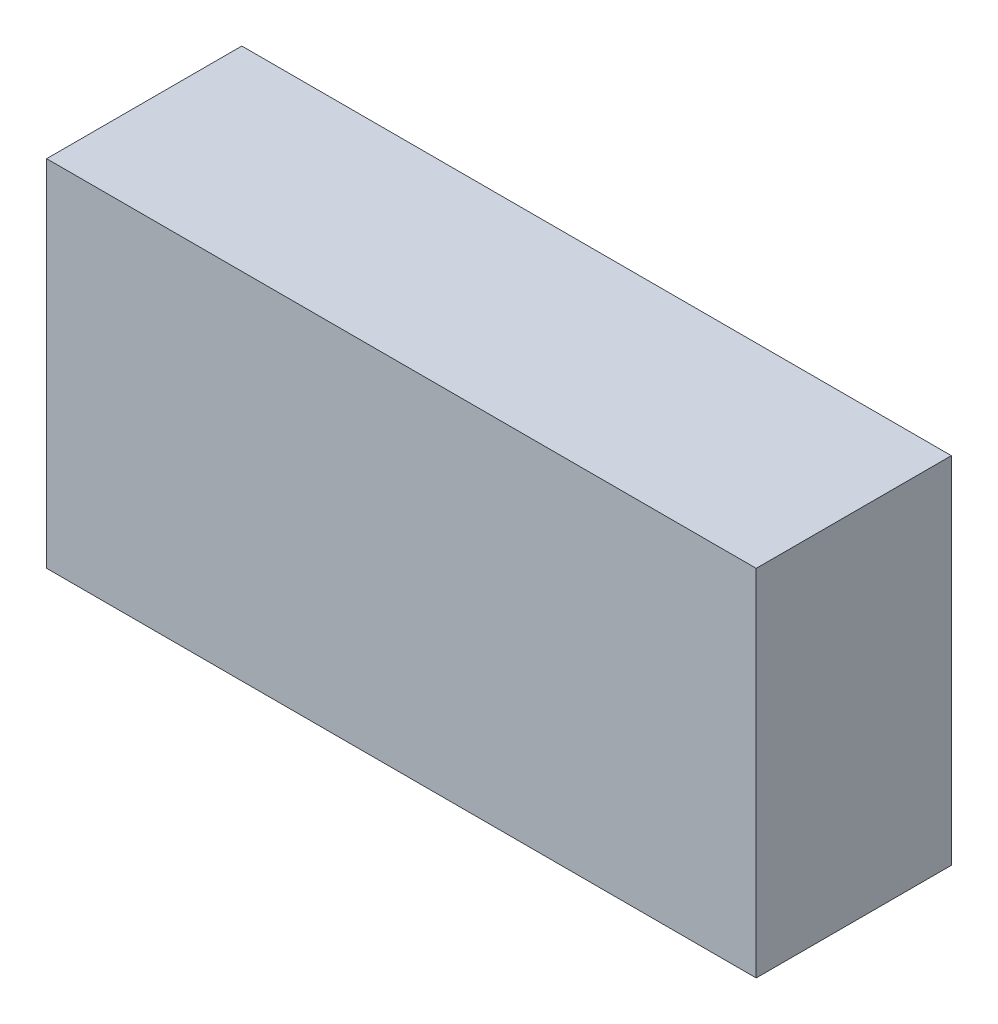
ISO-10303-21;
HEADER;
FILE_DESCRIPTION(('STEP AP214'),'2;1');
FILE_NAME('part.step','',(''),(''),'','','');
FILE_SCHEMA(('AUTOMOTIVE_DESIGN { 1 0 10303 214 1 1 1 1 }'));
ENDSEC;
DATA;
#1=APPLICATION_CONTEXT('core data for automotive mechanical design processes');
#2=APPLICATION_PROTOCOL_DEFINITION('international standard','automotive_design',2000,#1);
#3=PRODUCT_CONTEXT('',#1,'mechanical');
#4=PRODUCT('Part','Part','',(#3));
#5=PRODUCT_RELATED_PRODUCT_CATEGORY('part','',(#4));
#6=PRODUCT_DEFINITION_FORMATION('','',#4);
#7=PRODUCT_DEFINITION_CONTEXT('part definition',#1,'design');
#8=PRODUCT_DEFINITION('design','',#6,#7);
#9=PRODUCT_DEFINITION_SHAPE('','',#8);
#10=(LENGTH_UNIT() NAMED_UNIT(*) SI_UNIT(.MILLI.,.METRE.));
#11=(NAMED_UNIT(*) PLANE_ANGLE_UNIT() SI_UNIT($,.RADIAN.));
#12=(NAMED_UNIT(*) SI_UNIT($,.STERADIAN.) SOLID_ANGLE_UNIT());
#13=UNCERTAINTY_MEASURE_WITH_UNIT(LENGTH_MEASURE(1.E-05),#10,'distance_accuracy_value','');
#14=(GEOMETRIC_REPRESENTATION_CONTEXT(3) GLOBAL_UNCERTAINTY_ASSIGNED_CONTEXT((#13)) GLOBAL_UNIT_ASSIGNED_CONTEXT((#10,
#11,#12)) REPRESENTATION_CONTEXT('',''));
#15=CARTESIAN_POINT('',(0.,0.,0.));
#16=DIRECTION('',(0.,0.,1.));
#17=DIRECTION('',(1.,0.,0.));
#18=AXIS2_PLACEMENT_3D('',#15,#16,#17);
#19=CARTESIAN_POINT('',(0.,1.270000012702E-06,0.66010028));
#20=DIRECTION('',(0.,0.,1.));
#21=DIRECTION('',(1.,0.,0.));
#22=AXIS2_PLACEMENT_3D('',#19,#20,#21);
#23=PLANE('',#22);
#24=DIRECTION('',(0.,-1.,0.));
#25=VECTOR('',#24,1.);
#26=CARTESIAN_POINT('',(-1.20000014,0.60000134,0.66010028));
#27=LINE('',#26,#25);
#28=CARTESIAN_POINT('',(-1.20000014,0.60000134,0.66010028));
#29=VERTEX_POINT('',#28);
#30=CARTESIAN_POINT('',(-1.20000014,-0.5999988,0.66010028));
#31=VERTEX_POINT('',#30);
#32=EDGE_CURVE('E84',#29,#31,#27,.T.);
#33=ORIENTED_EDGE('',*,*,#32,.T.);
#34=DIRECTION('',(1.,0.,0.));
#35=VECTOR('',#34,1.);
#36=CARTESIAN_POINT('',(-1.20000014,-0.5999988,0.66010028));
#37=LINE('',#36,#35);
#38=CARTESIAN_POINT('',(1.20000014,-0.5999988,0.66010028));
#39=VERTEX_POINT('',#38);
#40=EDGE_CURVE('E82',#31,#39,#37,.T.);
#41=ORIENTED_EDGE('',*,*,#40,.T.);
#42=DIRECTION('',(0.,1.,0.));
#43=VECTOR('',#42,1.);
#44=CARTESIAN_POINT('',(1.20000014,-0.5999988,0.66010028));
#45=LINE('',#44,#43);
#46=CARTESIAN_POINT('',(1.20000014,0.60000134,0.66010028));
#47=VERTEX_POINT('',#46);
#48=EDGE_CURVE('E71',#39,#47,#45,.T.);
#49=ORIENTED_EDGE('',*,*,#48,.T.);
#50=DIRECTION('',(-1.,0.,0.));
#51=VECTOR('',#50,1.);
#52=CARTESIAN_POINT('',(1.20000014,0.60000134,0.66010028));
#53=LINE('',#52,#51);
#54=EDGE_CURVE('E11',#47,#29,#53,.T.);
#55=ORIENTED_EDGE('',*,*,#54,.T.);
#56=EDGE_LOOP('',(#33,#41,#49,#55));
#57=FACE_BOUND('',#56,.T.);
#58=ADVANCED_FACE('F16',(#57),#23,.T.);
#59=CARTESIAN_POINT('',(0.,1.270000012702E-06,0.));
#60=DIRECTION('',(0.,0.,1.));
#61=DIRECTION('',(1.,0.,0.));
#62=AXIS2_PLACEMENT_3D('',#59,#60,#61);
#63=PLANE('',#62);
#64=DIRECTION('',(0.,-1.,0.));
#65=VECTOR('',#64,1.);
#66=CARTESIAN_POINT('',(-1.20000014,0.60000134,0.));
#67=LINE('',#66,#65);
#68=CARTESIAN_POINT('',(-1.20000014,0.60000134,0.));
#69=VERTEX_POINT('',#68);
#70=CARTESIAN_POINT('',(-1.20000014,-0.5999988,0.));
#71=VERTEX_POINT('',#70);
#72=EDGE_CURVE('E20',#69,#71,#67,.T.);
#73=ORIENTED_EDGE('',*,*,#72,.F.);
#74=DIRECTION('',(-1.,0.,0.));
#75=VECTOR('',#74,1.);
#76=CARTESIAN_POINT('',(1.20000014,0.60000134,0.));
#77=LINE('',#76,#75);
#78=CARTESIAN_POINT('',(1.20000014,0.60000134,0.));
#79=VERTEX_POINT('',#78);
#80=EDGE_CURVE('E27',#79,#69,#77,.T.);
#81=ORIENTED_EDGE('',*,*,#80,.F.);
#82=DIRECTION('',(0.,1.,0.));
#83=VECTOR('',#82,1.);
#84=CARTESIAN_POINT('',(1.20000014,-0.5999988,0.));
#85=LINE('',#84,#83);
#86=CARTESIAN_POINT('',(1.20000014,-0.5999988,0.));
#87=VERTEX_POINT('',#86);
#88=EDGE_CURVE('E63',#87,#79,#85,.T.);
#89=ORIENTED_EDGE('',*,*,#88,.F.);
#90=DIRECTION('',(1.,0.,0.));
#91=VECTOR('',#90,1.);
#92=CARTESIAN_POINT('',(-1.20000014,-0.5999988,0.));
#93=LINE('',#92,#91);
#94=EDGE_CURVE('E91',#71,#87,#93,.T.);
#95=ORIENTED_EDGE('',*,*,#94,.F.);
#96=EDGE_LOOP('',(#73,#81,#89,#95));
#97=FACE_BOUND('',#96,.T.);
#98=ADVANCED_FACE('F111',(#97),#63,.F.);
#99=CARTESIAN_POINT('',(1.20000014,0.60000134,0.));
#100=DIRECTION('',(0.,-1.,0.));
#101=DIRECTION('',(0.,0.,-1.));
#102=AXIS2_PLACEMENT_3D('',#99,#100,#101);
#103=PLANE('',#102);
#104=DIRECTION('',(0.,0.,1.));
#105=VECTOR('',#104,1.);
#106=CARTESIAN_POINT('',(1.20000014,0.60000134,0.));
#107=LINE('',#106,#105);
#108=EDGE_CURVE('E77',#79,#47,#107,.T.);
#109=ORIENTED_EDGE('',*,*,#108,.F.);
#110=ORIENTED_EDGE('',*,*,#80,.T.);
#111=DIRECTION('',(0.,0.,1.));
#112=VECTOR('',#111,1.);
#113=CARTESIAN_POINT('',(-1.20000014,0.60000134,0.));
#114=LINE('',#113,#112);
#115=EDGE_CURVE('E109',#69,#29,#114,.T.);
#116=ORIENTED_EDGE('',*,*,#115,.T.);
#117=ORIENTED_EDGE('',*,*,#54,.F.);
#118=EDGE_LOOP('',(#109,#110,#116,#117));
#119=FACE_BOUND('',#118,.T.);
#120=ADVANCED_FACE('F107',(#119),#103,.F.);
#121=CARTESIAN_POINT('',(1.20000014,-0.5999988,0.));
#122=DIRECTION('',(-1.,0.,0.));
#123=DIRECTION('',(0.,0.,1.));
#124=AXIS2_PLACEMENT_3D('',#121,#122,#123);
#125=PLANE('',#124);
#126=DIRECTION('',(0.,0.,1.));
#127=VECTOR('',#126,1.);
#128=CARTESIAN_POINT('',(1.20000014,-0.5999988,0.));
#129=LINE('',#128,#127);
#130=EDGE_CURVE('E75',#87,#39,#129,.T.);
#131=ORIENTED_EDGE('',*,*,#130,.F.);
#132=ORIENTED_EDGE('',*,*,#88,.T.);
#133=ORIENTED_EDGE('',*,*,#108,.T.);
#134=ORIENTED_EDGE('',*,*,#48,.F.);
#135=EDGE_LOOP('',(#131,#132,#133,#134));
#136=FACE_BOUND('',#135,.T.);
#137=ADVANCED_FACE('F73',(#136),#125,.F.);
#138=CARTESIAN_POINT('',(-1.20000014,-0.5999988,0.));
#139=DIRECTION('',(0.,1.,0.));
#140=DIRECTION('',(1.,0.,0.));
#141=AXIS2_PLACEMENT_3D('',#138,#139,#140);
#142=PLANE('',#141);
#143=DIRECTION('',(0.,0.,1.));
#144=VECTOR('',#143,1.);
#145=CARTESIAN_POINT('',(-1.20000014,-0.5999988,0.));
#146=LINE('',#145,#144);
#147=EDGE_CURVE('E114',#71,#31,#146,.T.);
#148=ORIENTED_EDGE('',*,*,#147,.F.);
#149=ORIENTED_EDGE('',*,*,#94,.T.);
#150=ORIENTED_EDGE('',*,*,#130,.T.);
#151=ORIENTED_EDGE('',*,*,#40,.F.);
#152=EDGE_LOOP('',(#148,#149,#150,#151));
#153=FACE_BOUND('',#152,.T.);
#154=ADVANCED_FACE('F90',(#153),#142,.F.);
#155=CARTESIAN_POINT('',(-1.20000014,0.60000134,0.));
#156=DIRECTION('',(1.,0.,0.));
#157=DIRECTION('',(0.,1.,0.));
#158=AXIS2_PLACEMENT_3D('',#155,#156,#157);
#159=PLANE('',#158);
#160=ORIENTED_EDGE('',*,*,#115,.F.);
#161=ORIENTED_EDGE('',*,*,#72,.T.);
#162=ORIENTED_EDGE('',*,*,#147,.T.);
#163=ORIENTED_EDGE('',*,*,#32,.F.);
#164=EDGE_LOOP('',(#160,#161,#162,#163));
#165=FACE_BOUND('',#164,.T.);
#166=ADVANCED_FACE('F18',(#165),#159,.F.);
#167=CLOSED_SHELL('',(#58,#98,#120,#137,#154,#166));
#168=MANIFOLD_SOLID_BREP('B1',#167);
#169=ADVANCED_BREP_SHAPE_REPRESENTATION('',(#18,#168),#14);
#170=SHAPE_DEFINITION_REPRESENTATION(#9,#169);
ENDSEC;
END-ISO-10303-21;
